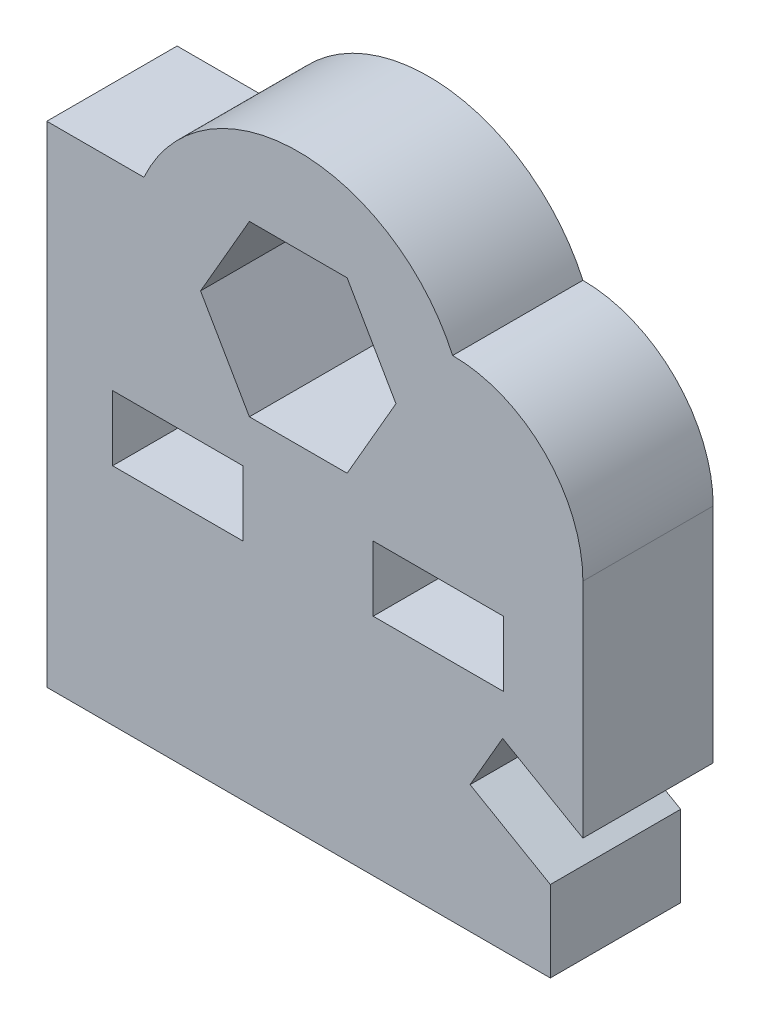
ISO-10303-21;
HEADER;
FILE_DESCRIPTION(('STEP AP214'),'2;1');
FILE_NAME('part.step','',(''),(''),'','','');
FILE_SCHEMA(('AUTOMOTIVE_DESIGN { 1 0 10303 214 1 1 1 1 }'));
ENDSEC;
DATA;
#1=APPLICATION_CONTEXT('core data for automotive mechanical design processes');
#2=APPLICATION_PROTOCOL_DEFINITION('international standard','automotive_design',2000,#1);
#3=PRODUCT_CONTEXT('',#1,'mechanical');
#4=PRODUCT('Part','Part','',(#3));
#5=PRODUCT_RELATED_PRODUCT_CATEGORY('part','',(#4));
#6=PRODUCT_DEFINITION_FORMATION('','',#4);
#7=PRODUCT_DEFINITION_CONTEXT('part definition',#1,'design');
#8=PRODUCT_DEFINITION('design','',#6,#7);
#9=PRODUCT_DEFINITION_SHAPE('','',#8);
#10=(LENGTH_UNIT() NAMED_UNIT(*) SI_UNIT(.MILLI.,.METRE.));
#11=(NAMED_UNIT(*) PLANE_ANGLE_UNIT() SI_UNIT($,.RADIAN.));
#12=(NAMED_UNIT(*) SI_UNIT($,.STERADIAN.) SOLID_ANGLE_UNIT());
#13=UNCERTAINTY_MEASURE_WITH_UNIT(LENGTH_MEASURE(1.E-05),#10,'distance_accuracy_value','');
#14=(GEOMETRIC_REPRESENTATION_CONTEXT(3) GLOBAL_UNCERTAINTY_ASSIGNED_CONTEXT((#13)) GLOBAL_UNIT_ASSIGNED_CONTEXT((#10,
#11,#12)) REPRESENTATION_CONTEXT('',''));
#15=CARTESIAN_POINT('',(0.,0.,0.));
#16=DIRECTION('',(0.,0.,1.));
#17=DIRECTION('',(1.,0.,0.));
#18=AXIS2_PLACEMENT_3D('',#15,#16,#17);
#19=CARTESIAN_POINT('',(13.9396736813884,13.1425512647541,4.));
#20=DIRECTION('',(0.,0.,1.));
#21=DIRECTION('',(1.,0.,0.));
#22=AXIS2_PLACEMENT_3D('',#19,#20,#21);
#23=PLANE('',#22);
#24=DIRECTION('',(0.,-1.,0.));
#25=VECTOR('',#24,1.);
#26=CARTESIAN_POINT('',(11.5,8.99107807997269,4.));
#27=LINE('',#26,#25);
#28=CARTESIAN_POINT('',(11.5,10.9910780799727,4.));
#29=VERTEX_POINT('',#28);
#30=CARTESIAN_POINT('',(11.5,8.99107807997269,4.));
#31=VERTEX_POINT('',#30);
#32=EDGE_CURVE('E247',#29,#31,#27,.T.);
#33=ORIENTED_EDGE('',*,*,#32,.F.);
#34=DIRECTION('',(-1.,0.,0.));
#35=VECTOR('',#34,1.);
#36=CARTESIAN_POINT('',(11.5,10.9910780799727,4.));
#37=LINE('',#36,#35);
#38=CARTESIAN_POINT('',(15.5,10.9910780799727,4.));
#39=VERTEX_POINT('',#38);
#40=EDGE_CURVE('E245',#39,#29,#37,.T.);
#41=ORIENTED_EDGE('',*,*,#40,.F.);
#42=DIRECTION('',(0.,1.,0.));
#43=VECTOR('',#42,1.);
#44=CARTESIAN_POINT('',(15.5,8.99107807997269,4.));
#45=LINE('',#44,#43);
#46=CARTESIAN_POINT('',(15.5,8.99107807997269,4.));
#47=VERTEX_POINT('',#46);
#48=EDGE_CURVE('E253',#47,#39,#45,.T.);
#49=ORIENTED_EDGE('',*,*,#48,.F.);
#50=DIRECTION('',(1.,0.,0.));
#51=VECTOR('',#50,1.);
#52=CARTESIAN_POINT('',(11.5,8.99107807997269,4.));
#53=LINE('',#52,#51);
#54=EDGE_CURVE('E250',#31,#47,#53,.T.);
#55=ORIENTED_EDGE('',*,*,#54,.F.);
#56=EDGE_LOOP('',(#33,#41,#49,#55));
#57=FACE_BOUND('',#56,.T.);
#58=CARTESIAN_POINT('',(13.9396736813884,13.1425512647541,4.));
#59=DIRECTION('',(0.,0.,1.));
#60=DIRECTION('',(1.,0.,0.));
#61=AXIS2_PLACEMENT_3D('',#58,#59,#60);
#62=CIRCLE('',#61,4.);
#63=CARTESIAN_POINT('',(17.9396736813884,13.142551264754,4.));
#64=VERTEX_POINT('',#63);
#65=CARTESIAN_POINT('',(13.9396736813883,17.1425512647541,4.));
#66=VERTEX_POINT('',#65);
#67=EDGE_CURVE('E307',#64,#66,#62,.T.);
#68=ORIENTED_EDGE('',*,*,#67,.T.);
#69=CARTESIAN_POINT('',(9.20000000000002,14.992551264754,4.));
#70=DIRECTION('',(0.,0.,1.));
#71=DIRECTION('',(1.,0.,0.));
#72=AXIS2_PLACEMENT_3D('',#69,#70,#71);
#73=CIRCLE('',#72,5.20451790332642);
#74=CARTESIAN_POINT('',(4.46032631861171,17.1425512647541,4.));
#75=VERTEX_POINT('',#74);
#76=EDGE_CURVE('E310',#66,#75,#73,.T.);
#77=ORIENTED_EDGE('',*,*,#76,.T.);
#78=DIRECTION('',(-1.,0.,0.));
#79=VECTOR('',#78,1.);
#80=CARTESIAN_POINT('',(4.46032631861171,17.1425512647541,4.));
#81=LINE('',#80,#79);
#82=CARTESIAN_POINT('',(1.48,17.1425512647541,4.));
#83=VERTEX_POINT('',#82);
#84=EDGE_CURVE('E313',#75,#83,#81,.T.);
#85=ORIENTED_EDGE('',*,*,#84,.T.);
#86=DIRECTION('',(0.,-1.,0.));
#87=VECTOR('',#86,1.);
#88=CARTESIAN_POINT('',(1.48,17.1425512647541,4.));
#89=LINE('',#88,#87);
#90=CARTESIAN_POINT('',(1.48,2.0910780799727,4.));
#91=VERTEX_POINT('',#90);
#92=EDGE_CURVE('E315',#83,#91,#89,.T.);
#93=ORIENTED_EDGE('',*,*,#92,.T.);
#94=DIRECTION('',(1.,0.,0.));
#95=VECTOR('',#94,1.);
#96=CARTESIAN_POINT('',(16.9396736813884,2.0910780799727,4.));
#97=LINE('',#96,#95);
#98=CARTESIAN_POINT('',(16.9396736813884,2.0910780799727,4.));
#99=VERTEX_POINT('',#98);
#100=EDGE_CURVE('E317',#91,#99,#97,.T.);
#101=ORIENTED_EDGE('',*,*,#100,.T.);
#102=DIRECTION('',(0.,1.,0.));
#103=VECTOR('',#102,1.);
#104=CARTESIAN_POINT('',(16.9396736813884,4.57735026918963,4.));
#105=LINE('',#104,#103);
#106=CARTESIAN_POINT('',(16.9396736813884,4.57735026918963,4.));
#107=VERTEX_POINT('',#106);
#108=EDGE_CURVE('E319',#99,#107,#105,.T.);
#109=ORIENTED_EDGE('',*,*,#108,.T.);
#110=DIRECTION('',(-0.866025403784438,0.5,0.));
#111=VECTOR('',#110,1.);
#112=CARTESIAN_POINT('',(14.4755720662506,6.,4.));
#113=LINE('',#112,#111);
#114=CARTESIAN_POINT('',(14.4755720662506,6.,4.));
#115=VERTEX_POINT('',#114);
#116=EDGE_CURVE('E321',#107,#115,#113,.T.);
#117=ORIENTED_EDGE('',*,*,#116,.T.);
#118=DIRECTION('',(0.500000000000005,0.866025403784436,0.));
#119=VECTOR('',#118,1.);
#120=CARTESIAN_POINT('',(14.4755720662506,6.,4.));
#121=LINE('',#120,#119);
#122=CARTESIAN_POINT('',(15.4755720662506,7.73205080756889,4.));
#123=VERTEX_POINT('',#122);
#124=EDGE_CURVE('E323',#115,#123,#121,.T.);
#125=ORIENTED_EDGE('',*,*,#124,.T.);
#126=DIRECTION('',(0.866025403784436,-0.500000000000005,0.));
#127=VECTOR('',#126,1.);
#128=CARTESIAN_POINT('',(15.4755720662506,7.73205080756889,4.));
#129=LINE('',#128,#127);
#130=CARTESIAN_POINT('',(17.9396736813884,6.30940107675851,4.));
#131=VERTEX_POINT('',#130);
#132=EDGE_CURVE('E325',#123,#131,#129,.T.);
#133=ORIENTED_EDGE('',*,*,#132,.T.);
#134=DIRECTION('',(0.,1.,0.));
#135=VECTOR('',#134,1.);
#136=CARTESIAN_POINT('',(17.9396736813884,13.142551264754,4.));
#137=LINE('',#136,#135);
#138=EDGE_CURVE('E327',#131,#64,#137,.T.);
#139=ORIENTED_EDGE('',*,*,#138,.T.);
#140=EDGE_LOOP('',(#68,#77,#85,#93,#101,#109,#117,#125,#133,#139));
#141=FACE_BOUND('',#140,.T.);
#142=DIRECTION('',(0.,-1.,0.));
#143=VECTOR('',#142,1.);
#144=CARTESIAN_POINT('',(3.5,8.99107807997269,4.));
#145=LINE('',#144,#143);
#146=CARTESIAN_POINT('',(3.5,10.9910780799727,4.));
#147=VERTEX_POINT('',#146);
#148=CARTESIAN_POINT('',(3.5,8.99107807997269,4.));
#149=VERTEX_POINT('',#148);
#150=EDGE_CURVE('E278',#147,#149,#145,.T.);
#151=ORIENTED_EDGE('',*,*,#150,.F.);
#152=DIRECTION('',(-1.,0.,0.));
#153=VECTOR('',#152,1.);
#154=CARTESIAN_POINT('',(3.5,10.9910780799727,4.));
#155=LINE('',#154,#153);
#156=CARTESIAN_POINT('',(7.5,10.9910780799727,4.));
#157=VERTEX_POINT('',#156);
#158=EDGE_CURVE('E276',#157,#147,#155,.T.);
#159=ORIENTED_EDGE('',*,*,#158,.F.);
#160=DIRECTION('',(0.,1.,0.));
#161=VECTOR('',#160,1.);
#162=CARTESIAN_POINT('',(7.5,8.99107807997269,4.));
#163=LINE('',#162,#161);
#164=CARTESIAN_POINT('',(7.5,8.99107807997269,4.));
#165=VERTEX_POINT('',#164);
#166=EDGE_CURVE('E284',#165,#157,#163,.T.);
#167=ORIENTED_EDGE('',*,*,#166,.F.);
#168=DIRECTION('',(1.,0.,0.));
#169=VECTOR('',#168,1.);
#170=CARTESIAN_POINT('',(3.5,8.99107807997269,4.));
#171=LINE('',#170,#169);
#172=EDGE_CURVE('E281',#149,#165,#171,.T.);
#173=ORIENTED_EDGE('',*,*,#172,.F.);
#174=EDGE_LOOP('',(#151,#159,#167,#173));
#175=FACE_BOUND('',#174,.T.);
#176=DIRECTION('',(0.500000000000001,-0.866025403784438,0.));
#177=VECTOR('',#176,1.);
#178=CARTESIAN_POINT('',(6.20000000000001,14.9910780799727,4.));
#179=LINE('',#178,#177);
#180=CARTESIAN_POINT('',(6.20000000000001,14.9910780799727,4.));
#181=VERTEX_POINT('',#180);
#182=CARTESIAN_POINT('',(7.70000000000002,12.3930018686194,4.));
#183=VERTEX_POINT('',#182);
#184=EDGE_CURVE('E202',#181,#183,#179,.T.);
#185=ORIENTED_EDGE('',*,*,#184,.F.);
#186=DIRECTION('',(-0.499999999999995,-0.866025403784442,0.));
#187=VECTOR('',#186,1.);
#188=CARTESIAN_POINT('',(7.69999999999998,17.589154291326,4.));
#189=LINE('',#188,#187);
#190=CARTESIAN_POINT('',(7.69999999999998,17.589154291326,4.));
#191=VERTEX_POINT('',#190);
#192=EDGE_CURVE('E194',#191,#181,#189,.T.);
#193=ORIENTED_EDGE('',*,*,#192,.F.);
#194=DIRECTION('',(-1.,0.,0.));
#195=VECTOR('',#194,1.);
#196=CARTESIAN_POINT('',(10.7,17.589154291326,4.));
#197=LINE('',#196,#195);
#198=CARTESIAN_POINT('',(10.7,17.589154291326,4.));
#199=VERTEX_POINT('',#198);
#200=EDGE_CURVE('E223',#199,#191,#197,.T.);
#201=ORIENTED_EDGE('',*,*,#200,.F.);
#202=DIRECTION('',(-0.500000000000007,0.866025403784435,0.));
#203=VECTOR('',#202,1.);
#204=CARTESIAN_POINT('',(12.2,14.9910780799727,4.));
#205=LINE('',#204,#203);
#206=CARTESIAN_POINT('',(12.2,14.9910780799727,4.));
#207=VERTEX_POINT('',#206);
#208=EDGE_CURVE('E221',#207,#199,#205,.T.);
#209=ORIENTED_EDGE('',*,*,#208,.F.);
#210=DIRECTION('',(0.499999999999995,0.866025403784442,0.));
#211=VECTOR('',#210,1.);
#212=CARTESIAN_POINT('',(10.7,12.3930018686194,4.));
#213=LINE('',#212,#211);
#214=CARTESIAN_POINT('',(10.7,12.3930018686194,4.));
#215=VERTEX_POINT('',#214);
#216=EDGE_CURVE('E217',#215,#207,#213,.T.);
#217=ORIENTED_EDGE('',*,*,#216,.F.);
#218=DIRECTION('',(1.,0.,0.));
#219=VECTOR('',#218,1.);
#220=CARTESIAN_POINT('',(7.70000000000002,12.3930018686194,4.));
#221=LINE('',#220,#219);
#222=EDGE_CURVE('E215',#183,#215,#221,.T.);
#223=ORIENTED_EDGE('',*,*,#222,.F.);
#224=EDGE_LOOP('',(#185,#193,#201,#209,#217,#223));
#225=FACE_BOUND('',#224,.T.);
#226=ADVANCED_FACE('F33',(#57,#141,#175,#225),#23,.T.);
#227=CARTESIAN_POINT('',(13.9396736813884,13.1425512647541,0.));
#228=DIRECTION('',(0.,0.,1.));
#229=DIRECTION('',(1.,0.,0.));
#230=AXIS2_PLACEMENT_3D('',#227,#228,#229);
#231=PLANE('',#230);
#232=DIRECTION('',(-1.,0.,0.));
#233=VECTOR('',#232,1.);
#234=CARTESIAN_POINT('',(11.5,10.9910780799727,0.));
#235=LINE('',#234,#233);
#236=CARTESIAN_POINT('',(15.5,10.9910780799727,0.));
#237=VERTEX_POINT('',#236);
#238=CARTESIAN_POINT('',(11.5,10.9910780799727,0.));
#239=VERTEX_POINT('',#238);
#240=EDGE_CURVE('E210',#237,#239,#235,.T.);
#241=ORIENTED_EDGE('',*,*,#240,.T.);
#242=DIRECTION('',(0.,-1.,0.));
#243=VECTOR('',#242,1.);
#244=CARTESIAN_POINT('',(11.5,8.99107807997269,0.));
#245=LINE('',#244,#243);
#246=CARTESIAN_POINT('',(11.5,8.99107807997269,0.));
#247=VERTEX_POINT('',#246);
#248=EDGE_CURVE('E258',#239,#247,#245,.T.);
#249=ORIENTED_EDGE('',*,*,#248,.T.);
#250=DIRECTION('',(1.,0.,0.));
#251=VECTOR('',#250,1.);
#252=CARTESIAN_POINT('',(11.5,8.99107807997269,0.));
#253=LINE('',#252,#251);
#254=CARTESIAN_POINT('',(15.5,8.99107807997269,0.));
#255=VERTEX_POINT('',#254);
#256=EDGE_CURVE('E261',#247,#255,#253,.T.);
#257=ORIENTED_EDGE('',*,*,#256,.T.);
#258=DIRECTION('',(0.,1.,0.));
#259=VECTOR('',#258,1.);
#260=CARTESIAN_POINT('',(15.5,8.99107807997269,0.));
#261=LINE('',#260,#259);
#262=EDGE_CURVE('E248',#255,#237,#261,.T.);
#263=ORIENTED_EDGE('',*,*,#262,.T.);
#264=EDGE_LOOP('',(#241,#249,#257,#263));
#265=FACE_BOUND('',#264,.T.);
#266=CARTESIAN_POINT('',(13.9396736813884,13.1425512647541,0.));
#267=DIRECTION('',(0.,0.,1.));
#268=DIRECTION('',(1.,0.,0.));
#269=AXIS2_PLACEMENT_3D('',#266,#267,#268);
#270=CIRCLE('',#269,4.);
#271=CARTESIAN_POINT('',(17.9396736813884,13.142551264754,0.));
#272=VERTEX_POINT('',#271);
#273=CARTESIAN_POINT('',(13.9396736813883,17.1425512647541,0.));
#274=VERTEX_POINT('',#273);
#275=EDGE_CURVE('E306',#272,#274,#270,.T.);
#276=ORIENTED_EDGE('',*,*,#275,.F.);
#277=DIRECTION('',(0.,1.,0.));
#278=VECTOR('',#277,1.);
#279=CARTESIAN_POINT('',(17.9396736813884,13.142551264754,0.));
#280=LINE('',#279,#278);
#281=CARTESIAN_POINT('',(17.9396736813884,6.30940107675851,0.));
#282=VERTEX_POINT('',#281);
#283=EDGE_CURVE('E311',#282,#272,#280,.T.);
#284=ORIENTED_EDGE('',*,*,#283,.F.);
#285=DIRECTION('',(0.866025403784436,-0.500000000000005,0.));
#286=VECTOR('',#285,1.);
#287=CARTESIAN_POINT('',(15.4755720662506,7.73205080756889,0.));
#288=LINE('',#287,#286);
#289=CARTESIAN_POINT('',(15.4755720662506,7.73205080756889,0.));
#290=VERTEX_POINT('',#289);
#291=EDGE_CURVE('E346',#290,#282,#288,.T.);
#292=ORIENTED_EDGE('',*,*,#291,.F.);
#293=DIRECTION('',(0.500000000000005,0.866025403784436,0.));
#294=VECTOR('',#293,1.);
#295=CARTESIAN_POINT('',(14.4755720662506,6.,0.));
#296=LINE('',#295,#294);
#297=CARTESIAN_POINT('',(14.4755720662506,6.,0.));
#298=VERTEX_POINT('',#297);
#299=EDGE_CURVE('E344',#298,#290,#296,.T.);
#300=ORIENTED_EDGE('',*,*,#299,.F.);
#301=DIRECTION('',(-0.866025403784438,0.5,0.));
#302=VECTOR('',#301,1.);
#303=CARTESIAN_POINT('',(14.4755720662506,6.,0.));
#304=LINE('',#303,#302);
#305=CARTESIAN_POINT('',(16.9396736813884,4.57735026918963,0.));
#306=VERTEX_POINT('',#305);
#307=EDGE_CURVE('E342',#306,#298,#304,.T.);
#308=ORIENTED_EDGE('',*,*,#307,.F.);
#309=DIRECTION('',(0.,1.,0.));
#310=VECTOR('',#309,1.);
#311=CARTESIAN_POINT('',(16.9396736813884,4.57735026918963,0.));
#312=LINE('',#311,#310);
#313=CARTESIAN_POINT('',(16.9396736813884,2.0910780799727,0.));
#314=VERTEX_POINT('',#313);
#315=EDGE_CURVE('E340',#314,#306,#312,.T.);
#316=ORIENTED_EDGE('',*,*,#315,.F.);
#317=DIRECTION('',(1.,0.,0.));
#318=VECTOR('',#317,1.);
#319=CARTESIAN_POINT('',(16.9396736813884,2.0910780799727,0.));
#320=LINE('',#319,#318);
#321=CARTESIAN_POINT('',(1.48,2.0910780799727,0.));
#322=VERTEX_POINT('',#321);
#323=EDGE_CURVE('E338',#322,#314,#320,.T.);
#324=ORIENTED_EDGE('',*,*,#323,.F.);
#325=DIRECTION('',(0.,-1.,0.));
#326=VECTOR('',#325,1.);
#327=CARTESIAN_POINT('',(1.48,17.1425512647541,0.));
#328=LINE('',#327,#326);
#329=CARTESIAN_POINT('',(1.48,17.1425512647541,0.));
#330=VERTEX_POINT('',#329);
#331=EDGE_CURVE('E336',#330,#322,#328,.T.);
#332=ORIENTED_EDGE('',*,*,#331,.F.);
#333=DIRECTION('',(-1.,0.,0.));
#334=VECTOR('',#333,1.);
#335=CARTESIAN_POINT('',(4.46032631861171,17.1425512647541,0.));
#336=LINE('',#335,#334);
#337=CARTESIAN_POINT('',(4.46032631861171,17.1425512647541,0.));
#338=VERTEX_POINT('',#337);
#339=EDGE_CURVE('E334',#338,#330,#336,.T.);
#340=ORIENTED_EDGE('',*,*,#339,.F.);
#341=CARTESIAN_POINT('',(9.20000000000002,14.992551264754,0.));
#342=DIRECTION('',(0.,0.,1.));
#343=DIRECTION('',(1.,0.,0.));
#344=AXIS2_PLACEMENT_3D('',#341,#342,#343);
#345=CIRCLE('',#344,5.20451790332642);
#346=EDGE_CURVE('E332',#274,#338,#345,.T.);
#347=ORIENTED_EDGE('',*,*,#346,.F.);
#348=EDGE_LOOP('',(#276,#284,#292,#300,#308,#316,#324,#332,#340,#347));
#349=FACE_BOUND('',#348,.T.);
#350=DIRECTION('',(-1.,0.,0.));
#351=VECTOR('',#350,1.);
#352=CARTESIAN_POINT('',(3.5,10.9910780799727,0.));
#353=LINE('',#352,#351);
#354=CARTESIAN_POINT('',(7.5,10.9910780799727,0.));
#355=VERTEX_POINT('',#354);
#356=CARTESIAN_POINT('',(3.5,10.9910780799727,0.));
#357=VERTEX_POINT('',#356);
#358=EDGE_CURVE('E275',#355,#357,#353,.T.);
#359=ORIENTED_EDGE('',*,*,#358,.T.);
#360=DIRECTION('',(0.,-1.,0.));
#361=VECTOR('',#360,1.);
#362=CARTESIAN_POINT('',(3.5,8.99107807997269,0.));
#363=LINE('',#362,#361);
#364=CARTESIAN_POINT('',(3.5,8.99107807997269,0.));
#365=VERTEX_POINT('',#364);
#366=EDGE_CURVE('E289',#357,#365,#363,.T.);
#367=ORIENTED_EDGE('',*,*,#366,.T.);
#368=DIRECTION('',(1.,0.,0.));
#369=VECTOR('',#368,1.);
#370=CARTESIAN_POINT('',(3.5,8.99107807997269,0.));
#371=LINE('',#370,#369);
#372=CARTESIAN_POINT('',(7.5,8.99107807997269,0.));
#373=VERTEX_POINT('',#372);
#374=EDGE_CURVE('E292',#365,#373,#371,.T.);
#375=ORIENTED_EDGE('',*,*,#374,.T.);
#376=DIRECTION('',(0.,1.,0.));
#377=VECTOR('',#376,1.);
#378=CARTESIAN_POINT('',(7.5,8.99107807997269,0.));
#379=LINE('',#378,#377);
#380=EDGE_CURVE('E279',#373,#355,#379,.T.);
#381=ORIENTED_EDGE('',*,*,#380,.T.);
#382=EDGE_LOOP('',(#359,#367,#375,#381));
#383=FACE_BOUND('',#382,.T.);
#384=DIRECTION('',(-0.499999999999995,-0.866025403784442,0.));
#385=VECTOR('',#384,1.);
#386=CARTESIAN_POINT('',(7.69999999999998,17.589154291326,0.));
#387=LINE('',#386,#385);
#388=CARTESIAN_POINT('',(7.69999999999998,17.589154291326,0.));
#389=VERTEX_POINT('',#388);
#390=CARTESIAN_POINT('',(6.20000000000001,14.9910780799727,0.));
#391=VERTEX_POINT('',#390);
#392=EDGE_CURVE('E56',#389,#391,#387,.T.);
#393=ORIENTED_EDGE('',*,*,#392,.T.);
#394=DIRECTION('',(0.500000000000001,-0.866025403784438,0.));
#395=VECTOR('',#394,1.);
#396=CARTESIAN_POINT('',(6.20000000000001,14.9910780799727,0.));
#397=LINE('',#396,#395);
#398=CARTESIAN_POINT('',(7.70000000000002,12.3930018686194,0.));
#399=VERTEX_POINT('',#398);
#400=EDGE_CURVE('E209',#391,#399,#397,.T.);
#401=ORIENTED_EDGE('',*,*,#400,.T.);
#402=DIRECTION('',(1.,0.,0.));
#403=VECTOR('',#402,1.);
#404=CARTESIAN_POINT('',(7.70000000000002,12.3930018686194,0.));
#405=LINE('',#404,#403);
#406=CARTESIAN_POINT('',(10.7,12.3930018686194,0.));
#407=VERTEX_POINT('',#406);
#408=EDGE_CURVE('E227',#399,#407,#405,.T.);
#409=ORIENTED_EDGE('',*,*,#408,.T.);
#410=DIRECTION('',(0.499999999999995,0.866025403784442,0.));
#411=VECTOR('',#410,1.);
#412=CARTESIAN_POINT('',(10.7,12.3930018686194,0.));
#413=LINE('',#412,#411);
#414=CARTESIAN_POINT('',(12.2,14.9910780799727,0.));
#415=VERTEX_POINT('',#414);
#416=EDGE_CURVE('E230',#407,#415,#413,.T.);
#417=ORIENTED_EDGE('',*,*,#416,.T.);
#418=DIRECTION('',(-0.500000000000007,0.866025403784435,0.));
#419=VECTOR('',#418,1.);
#420=CARTESIAN_POINT('',(12.2,14.9910780799727,0.));
#421=LINE('',#420,#419);
#422=CARTESIAN_POINT('',(10.7,17.589154291326,0.));
#423=VERTEX_POINT('',#422);
#424=EDGE_CURVE('E233',#415,#423,#421,.T.);
#425=ORIENTED_EDGE('',*,*,#424,.T.);
#426=DIRECTION('',(-1.,0.,0.));
#427=VECTOR('',#426,1.);
#428=CARTESIAN_POINT('',(10.7,17.589154291326,0.));
#429=LINE('',#428,#427);
#430=EDGE_CURVE('E203',#423,#389,#429,.T.);
#431=ORIENTED_EDGE('',*,*,#430,.T.);
#432=EDGE_LOOP('',(#393,#401,#409,#417,#425,#431));
#433=FACE_BOUND('',#432,.T.);
#434=ADVANCED_FACE('F382',(#265,#349,#383,#433),#231,.F.);
#435=CARTESIAN_POINT('',(13.9396736813884,13.1425512647541,4.));
#436=DIRECTION('',(0.,0.,-1.));
#437=DIRECTION('',(-1.,0.,0.));
#438=AXIS2_PLACEMENT_3D('',#435,#436,#437);
#439=CYLINDRICAL_SURFACE('',#438,4.);
#440=ORIENTED_EDGE('',*,*,#275,.T.);
#441=DIRECTION('',(0.,0.,-1.));
#442=VECTOR('',#441,1.);
#443=CARTESIAN_POINT('',(13.9396736813883,17.1425512647541,4.));
#444=LINE('',#443,#442);
#445=EDGE_CURVE('E11',#66,#274,#444,.T.);
#446=ORIENTED_EDGE('',*,*,#445,.F.);
#447=ORIENTED_EDGE('',*,*,#67,.F.);
#448=DIRECTION('',(0.,0.,-1.));
#449=VECTOR('',#448,1.);
#450=CARTESIAN_POINT('',(17.9396736813884,13.142551264754,4.));
#451=LINE('',#450,#449);
#452=EDGE_CURVE('E329',#64,#272,#451,.T.);
#453=ORIENTED_EDGE('',*,*,#452,.T.);
#454=EDGE_LOOP('',(#440,#446,#447,#453));
#455=FACE_BOUND('',#454,.T.);
#456=ADVANCED_FACE('F35',(#455),#439,.T.);
#457=CARTESIAN_POINT('',(9.20000000000002,14.992551264754,4.));
#458=DIRECTION('',(0.,0.,-1.));
#459=DIRECTION('',(-1.,0.,0.));
#460=AXIS2_PLACEMENT_3D('',#457,#458,#459);
#461=CYLINDRICAL_SURFACE('',#460,5.20451790332642);
#462=ORIENTED_EDGE('',*,*,#346,.T.);
#463=DIRECTION('',(0.,0.,-1.));
#464=VECTOR('',#463,1.);
#465=CARTESIAN_POINT('',(4.46032631861171,17.1425512647541,4.));
#466=LINE('',#465,#464);
#467=EDGE_CURVE('E41',#75,#338,#466,.T.);
#468=ORIENTED_EDGE('',*,*,#467,.F.);
#469=ORIENTED_EDGE('',*,*,#76,.F.);
#470=ORIENTED_EDGE('',*,*,#445,.T.);
#471=EDGE_LOOP('',(#462,#468,#469,#470));
#472=FACE_BOUND('',#471,.T.);
#473=ADVANCED_FACE('F400',(#472),#461,.T.);
#474=CARTESIAN_POINT('',(4.46032631861171,17.1425512647541,4.));
#475=DIRECTION('',(0.,-1.,0.));
#476=DIRECTION('',(0.,0.,-1.));
#477=AXIS2_PLACEMENT_3D('',#474,#475,#476);
#478=PLANE('',#477);
#479=ORIENTED_EDGE('',*,*,#339,.T.);
#480=DIRECTION('',(0.,0.,-1.));
#481=VECTOR('',#480,1.);
#482=CARTESIAN_POINT('',(1.48,17.1425512647541,4.));
#483=LINE('',#482,#481);
#484=EDGE_CURVE('E369',#83,#330,#483,.T.);
#485=ORIENTED_EDGE('',*,*,#484,.F.);
#486=ORIENTED_EDGE('',*,*,#84,.F.);
#487=ORIENTED_EDGE('',*,*,#467,.T.);
#488=EDGE_LOOP('',(#479,#485,#486,#487));
#489=FACE_BOUND('',#488,.T.);
#490=ADVANCED_FACE('F376',(#489),#478,.F.);
#491=CARTESIAN_POINT('',(1.48,17.1425512647541,4.));
#492=DIRECTION('',(1.,0.,0.));
#493=DIRECTION('',(0.,1.,0.));
#494=AXIS2_PLACEMENT_3D('',#491,#492,#493);
#495=PLANE('',#494);
#496=ORIENTED_EDGE('',*,*,#331,.T.);
#497=DIRECTION('',(0.,0.,-1.));
#498=VECTOR('',#497,1.);
#499=CARTESIAN_POINT('',(1.48,2.0910780799727,4.));
#500=LINE('',#499,#498);
#501=EDGE_CURVE('E366',#91,#322,#500,.T.);
#502=ORIENTED_EDGE('',*,*,#501,.F.);
#503=ORIENTED_EDGE('',*,*,#92,.F.);
#504=ORIENTED_EDGE('',*,*,#484,.T.);
#505=EDGE_LOOP('',(#496,#502,#503,#504));
#506=FACE_BOUND('',#505,.T.);
#507=ADVANCED_FACE('F388',(#506),#495,.F.);
#508=CARTESIAN_POINT('',(16.9396736813884,2.0910780799727,4.));
#509=DIRECTION('',(0.,1.,0.));
#510=DIRECTION('',(-1.,0.,0.));
#511=AXIS2_PLACEMENT_3D('',#508,#509,#510);
#512=PLANE('',#511);
#513=ORIENTED_EDGE('',*,*,#323,.T.);
#514=DIRECTION('',(0.,0.,-1.));
#515=VECTOR('',#514,1.);
#516=CARTESIAN_POINT('',(16.9396736813884,2.0910780799727,4.));
#517=LINE('',#516,#515);
#518=EDGE_CURVE('E363',#99,#314,#517,.T.);
#519=ORIENTED_EDGE('',*,*,#518,.F.);
#520=ORIENTED_EDGE('',*,*,#100,.F.);
#521=ORIENTED_EDGE('',*,*,#501,.T.);
#522=EDGE_LOOP('',(#513,#519,#520,#521));
#523=FACE_BOUND('',#522,.T.);
#524=ADVANCED_FACE('F392',(#523),#512,.F.);
#525=CARTESIAN_POINT('',(16.9396736813884,4.57735026918963,4.));
#526=DIRECTION('',(-1.,0.,0.));
#527=DIRECTION('',(0.,0.,1.));
#528=AXIS2_PLACEMENT_3D('',#525,#526,#527);
#529=PLANE('',#528);
#530=ORIENTED_EDGE('',*,*,#315,.T.);
#531=DIRECTION('',(0.,0.,-1.));
#532=VECTOR('',#531,1.);
#533=CARTESIAN_POINT('',(16.9396736813884,4.57735026918963,4.));
#534=LINE('',#533,#532);
#535=EDGE_CURVE('E360',#107,#306,#534,.T.);
#536=ORIENTED_EDGE('',*,*,#535,.F.);
#537=ORIENTED_EDGE('',*,*,#108,.F.);
#538=ORIENTED_EDGE('',*,*,#518,.T.);
#539=EDGE_LOOP('',(#530,#536,#537,#538));
#540=FACE_BOUND('',#539,.T.);
#541=ADVANCED_FACE('F423',(#540),#529,.F.);
#542=CARTESIAN_POINT('',(14.4755720662506,6.,4.));
#543=DIRECTION('',(-0.5,-0.866025403784438,0.));
#544=DIRECTION('',(0.866025403784438,-0.5,0.));
#545=AXIS2_PLACEMENT_3D('',#542,#543,#544);
#546=PLANE('',#545);
#547=ORIENTED_EDGE('',*,*,#307,.T.);
#548=DIRECTION('',(0.,0.,-1.));
#549=VECTOR('',#548,1.);
#550=CARTESIAN_POINT('',(14.4755720662506,6.,4.));
#551=LINE('',#550,#549);
#552=EDGE_CURVE('E357',#115,#298,#551,.T.);
#553=ORIENTED_EDGE('',*,*,#552,.F.);
#554=ORIENTED_EDGE('',*,*,#116,.F.);
#555=ORIENTED_EDGE('',*,*,#535,.T.);
#556=EDGE_LOOP('',(#547,#553,#554,#555));
#557=FACE_BOUND('',#556,.T.);
#558=ADVANCED_FACE('F420',(#557),#546,.F.);
#559=CARTESIAN_POINT('',(14.4755720662506,6.,4.));
#560=DIRECTION('',(-0.866025403784436,0.500000000000005,0.));
#561=DIRECTION('',(-0.500000000000005,-0.866025403784436,0.));
#562=AXIS2_PLACEMENT_3D('',#559,#560,#561);
#563=PLANE('',#562);
#564=ORIENTED_EDGE('',*,*,#299,.T.);
#565=DIRECTION('',(0.,0.,-1.));
#566=VECTOR('',#565,1.);
#567=CARTESIAN_POINT('',(15.4755720662506,7.73205080756889,4.));
#568=LINE('',#567,#566);
#569=EDGE_CURVE('E354',#123,#290,#568,.T.);
#570=ORIENTED_EDGE('',*,*,#569,.F.);
#571=ORIENTED_EDGE('',*,*,#124,.F.);
#572=ORIENTED_EDGE('',*,*,#552,.T.);
#573=EDGE_LOOP('',(#564,#570,#571,#572));
#574=FACE_BOUND('',#573,.T.);
#575=ADVANCED_FACE('F416',(#574),#563,.F.);
#576=CARTESIAN_POINT('',(15.4755720662506,7.73205080756889,4.));
#577=DIRECTION('',(0.500000000000005,0.866025403784436,0.));
#578=DIRECTION('',(-0.866025403784436,0.500000000000005,0.));
#579=AXIS2_PLACEMENT_3D('',#576,#577,#578);
#580=PLANE('',#579);
#581=ORIENTED_EDGE('',*,*,#291,.T.);
#582=DIRECTION('',(0.,0.,-1.));
#583=VECTOR('',#582,1.);
#584=CARTESIAN_POINT('',(17.9396736813884,6.30940107675851,4.));
#585=LINE('',#584,#583);
#586=EDGE_CURVE('E351',#131,#282,#585,.T.);
#587=ORIENTED_EDGE('',*,*,#586,.F.);
#588=ORIENTED_EDGE('',*,*,#132,.F.);
#589=ORIENTED_EDGE('',*,*,#569,.T.);
#590=EDGE_LOOP('',(#581,#587,#588,#589));
#591=FACE_BOUND('',#590,.T.);
#592=ADVANCED_FACE('F412',(#591),#580,.F.);
#593=CARTESIAN_POINT('',(17.9396736813884,13.142551264754,4.));
#594=DIRECTION('',(-1.,0.,0.));
#595=DIRECTION('',(0.,0.,1.));
#596=AXIS2_PLACEMENT_3D('',#593,#594,#595);
#597=PLANE('',#596);
#598=ORIENTED_EDGE('',*,*,#283,.T.);
#599=ORIENTED_EDGE('',*,*,#452,.F.);
#600=ORIENTED_EDGE('',*,*,#138,.F.);
#601=ORIENTED_EDGE('',*,*,#586,.T.);
#602=EDGE_LOOP('',(#598,#599,#600,#601));
#603=FACE_BOUND('',#602,.T.);
#604=ADVANCED_FACE('F407',(#603),#597,.F.);
#605=CARTESIAN_POINT('',(3.5,10.9910780799727,4.));
#606=DIRECTION('',(0.,-1.,0.));
#607=DIRECTION('',(0.,0.,-1.));
#608=AXIS2_PLACEMENT_3D('',#605,#606,#607);
#609=PLANE('',#608);
#610=ORIENTED_EDGE('',*,*,#358,.F.);
#611=DIRECTION('',(0.,0.,-1.));
#612=VECTOR('',#611,1.);
#613=CARTESIAN_POINT('',(7.5,10.9910780799727,4.));
#614=LINE('',#613,#612);
#615=EDGE_CURVE('E286',#157,#355,#614,.T.);
#616=ORIENTED_EDGE('',*,*,#615,.F.);
#617=ORIENTED_EDGE('',*,*,#158,.T.);
#618=DIRECTION('',(0.,0.,-1.));
#619=VECTOR('',#618,1.);
#620=CARTESIAN_POINT('',(3.5,10.9910780799727,4.));
#621=LINE('',#620,#619);
#622=EDGE_CURVE('E303',#147,#357,#621,.T.);
#623=ORIENTED_EDGE('',*,*,#622,.T.);
#624=EDGE_LOOP('',(#610,#616,#617,#623));
#625=FACE_BOUND('',#624,.T.);
#626=ADVANCED_FACE('F442',(#625),#609,.T.);
#627=CARTESIAN_POINT('',(3.5,8.99107807997269,4.));
#628=DIRECTION('',(1.,0.,0.));
#629=DIRECTION('',(0.,0.,-1.));
#630=AXIS2_PLACEMENT_3D('',#627,#628,#629);
#631=PLANE('',#630);
#632=ORIENTED_EDGE('',*,*,#366,.F.);
#633=ORIENTED_EDGE('',*,*,#622,.F.);
#634=ORIENTED_EDGE('',*,*,#150,.T.);
#635=DIRECTION('',(0.,0.,-1.));
#636=VECTOR('',#635,1.);
#637=CARTESIAN_POINT('',(3.5,8.99107807997269,4.));
#638=LINE('',#637,#636);
#639=EDGE_CURVE('E301',#149,#365,#638,.T.);
#640=ORIENTED_EDGE('',*,*,#639,.T.);
#641=EDGE_LOOP('',(#632,#633,#634,#640));
#642=FACE_BOUND('',#641,.T.);
#643=ADVANCED_FACE('F468',(#642),#631,.T.);
#644=CARTESIAN_POINT('',(3.5,8.99107807997269,4.));
#645=DIRECTION('',(0.,1.,0.));
#646=DIRECTION('',(0.,0.,1.));
#647=AXIS2_PLACEMENT_3D('',#644,#645,#646);
#648=PLANE('',#647);
#649=ORIENTED_EDGE('',*,*,#374,.F.);
#650=ORIENTED_EDGE('',*,*,#639,.F.);
#651=ORIENTED_EDGE('',*,*,#172,.T.);
#652=DIRECTION('',(0.,0.,-1.));
#653=VECTOR('',#652,1.);
#654=CARTESIAN_POINT('',(7.5,8.99107807997269,4.));
#655=LINE('',#654,#653);
#656=EDGE_CURVE('E299',#165,#373,#655,.T.);
#657=ORIENTED_EDGE('',*,*,#656,.T.);
#658=EDGE_LOOP('',(#649,#650,#651,#657));
#659=FACE_BOUND('',#658,.T.);
#660=ADVANCED_FACE('F475',(#659),#648,.T.);
#661=CARTESIAN_POINT('',(7.5,8.99107807997269,4.));
#662=DIRECTION('',(-1.,0.,0.));
#663=DIRECTION('',(0.,0.,1.));
#664=AXIS2_PLACEMENT_3D('',#661,#662,#663);
#665=PLANE('',#664);
#666=ORIENTED_EDGE('',*,*,#380,.F.);
#667=ORIENTED_EDGE('',*,*,#656,.F.);
#668=ORIENTED_EDGE('',*,*,#166,.T.);
#669=ORIENTED_EDGE('',*,*,#615,.T.);
#670=EDGE_LOOP('',(#666,#667,#668,#669));
#671=FACE_BOUND('',#670,.T.);
#672=ADVANCED_FACE('F482',(#671),#665,.T.);
#673=CARTESIAN_POINT('',(11.5,10.9910780799727,4.));
#674=DIRECTION('',(0.,-1.,0.));
#675=DIRECTION('',(0.,0.,-1.));
#676=AXIS2_PLACEMENT_3D('',#673,#674,#675);
#677=PLANE('',#676);
#678=ORIENTED_EDGE('',*,*,#240,.F.);
#679=DIRECTION('',(0.,0.,-1.));
#680=VECTOR('',#679,1.);
#681=CARTESIAN_POINT('',(15.5,10.9910780799727,4.));
#682=LINE('',#681,#680);
#683=EDGE_CURVE('E255',#39,#237,#682,.T.);
#684=ORIENTED_EDGE('',*,*,#683,.F.);
#685=ORIENTED_EDGE('',*,*,#40,.T.);
#686=DIRECTION('',(0.,0.,-1.));
#687=VECTOR('',#686,1.);
#688=CARTESIAN_POINT('',(11.5,10.9910780799727,4.));
#689=LINE('',#688,#687);
#690=EDGE_CURVE('E272',#29,#239,#689,.T.);
#691=ORIENTED_EDGE('',*,*,#690,.T.);
#692=EDGE_LOOP('',(#678,#684,#685,#691));
#693=FACE_BOUND('',#692,.T.);
#694=ADVANCED_FACE('F490',(#693),#677,.T.);
#695=CARTESIAN_POINT('',(11.5,8.99107807997269,4.));
#696=DIRECTION('',(1.,0.,0.));
#697=DIRECTION('',(0.,0.,-1.));
#698=AXIS2_PLACEMENT_3D('',#695,#696,#697);
#699=PLANE('',#698);
#700=ORIENTED_EDGE('',*,*,#248,.F.);
#701=ORIENTED_EDGE('',*,*,#690,.F.);
#702=ORIENTED_EDGE('',*,*,#32,.T.);
#703=DIRECTION('',(0.,0.,-1.));
#704=VECTOR('',#703,1.);
#705=CARTESIAN_POINT('',(11.5,8.99107807997269,4.));
#706=LINE('',#705,#704);
#707=EDGE_CURVE('E270',#31,#247,#706,.T.);
#708=ORIENTED_EDGE('',*,*,#707,.T.);
#709=EDGE_LOOP('',(#700,#701,#702,#708));
#710=FACE_BOUND('',#709,.T.);
#711=ADVANCED_FACE('F498',(#710),#699,.T.);
#712=CARTESIAN_POINT('',(11.5,8.99107807997269,4.));
#713=DIRECTION('',(0.,1.,0.));
#714=DIRECTION('',(0.,0.,1.));
#715=AXIS2_PLACEMENT_3D('',#712,#713,#714);
#716=PLANE('',#715);
#717=ORIENTED_EDGE('',*,*,#256,.F.);
#718=ORIENTED_EDGE('',*,*,#707,.F.);
#719=ORIENTED_EDGE('',*,*,#54,.T.);
#720=DIRECTION('',(0.,0.,-1.));
#721=VECTOR('',#720,1.);
#722=CARTESIAN_POINT('',(15.5,8.99107807997269,4.));
#723=LINE('',#722,#721);
#724=EDGE_CURVE('E268',#47,#255,#723,.T.);
#725=ORIENTED_EDGE('',*,*,#724,.T.);
#726=EDGE_LOOP('',(#717,#718,#719,#725));
#727=FACE_BOUND('',#726,.T.);
#728=ADVANCED_FACE('F506',(#727),#716,.T.);
#729=CARTESIAN_POINT('',(15.5,8.99107807997269,4.));
#730=DIRECTION('',(-1.,0.,0.));
#731=DIRECTION('',(0.,0.,1.));
#732=AXIS2_PLACEMENT_3D('',#729,#730,#731);
#733=PLANE('',#732);
#734=ORIENTED_EDGE('',*,*,#262,.F.);
#735=ORIENTED_EDGE('',*,*,#724,.F.);
#736=ORIENTED_EDGE('',*,*,#48,.T.);
#737=ORIENTED_EDGE('',*,*,#683,.T.);
#738=EDGE_LOOP('',(#734,#735,#736,#737));
#739=FACE_BOUND('',#738,.T.);
#740=ADVANCED_FACE('F514',(#739),#733,.T.);
#741=CARTESIAN_POINT('',(7.69999999999998,17.589154291326,4.));
#742=DIRECTION('',(0.866025403784442,-0.499999999999995,0.));
#743=DIRECTION('',(0.499999999999995,0.866025403784442,0.));
#744=AXIS2_PLACEMENT_3D('',#741,#742,#743);
#745=PLANE('',#744);
#746=ORIENTED_EDGE('',*,*,#392,.F.);
#747=DIRECTION('',(0.,0.,-1.));
#748=VECTOR('',#747,1.);
#749=CARTESIAN_POINT('',(7.69999999999998,17.589154291326,4.));
#750=LINE('',#749,#748);
#751=EDGE_CURVE('E198',#191,#389,#750,.T.);
#752=ORIENTED_EDGE('',*,*,#751,.F.);
#753=ORIENTED_EDGE('',*,*,#192,.T.);
#754=DIRECTION('',(0.,0.,-1.));
#755=VECTOR('',#754,1.);
#756=CARTESIAN_POINT('',(6.20000000000001,14.9910780799727,4.));
#757=LINE('',#756,#755);
#758=EDGE_CURVE('E197',#181,#391,#757,.T.);
#759=ORIENTED_EDGE('',*,*,#758,.T.);
#760=EDGE_LOOP('',(#746,#752,#753,#759));
#761=FACE_BOUND('',#760,.T.);
#762=ADVANCED_FACE('F196',(#761),#745,.T.);
#763=CARTESIAN_POINT('',(6.20000000000001,14.9910780799727,4.));
#764=DIRECTION('',(0.866025403784438,0.500000000000001,0.));
#765=DIRECTION('',(-0.500000000000001,0.866025403784438,0.));
#766=AXIS2_PLACEMENT_3D('',#763,#764,#765);
#767=PLANE('',#766);
#768=ORIENTED_EDGE('',*,*,#400,.F.);
#769=ORIENTED_EDGE('',*,*,#758,.F.);
#770=ORIENTED_EDGE('',*,*,#184,.T.);
#771=DIRECTION('',(0.,0.,-1.));
#772=VECTOR('',#771,1.);
#773=CARTESIAN_POINT('',(7.70000000000002,12.3930018686194,4.));
#774=LINE('',#773,#772);
#775=EDGE_CURVE('E211',#183,#399,#774,.T.);
#776=ORIENTED_EDGE('',*,*,#775,.T.);
#777=EDGE_LOOP('',(#768,#769,#770,#776));
#778=FACE_BOUND('',#777,.T.);
#779=ADVANCED_FACE('F206',(#778),#767,.T.);
#780=CARTESIAN_POINT('',(7.70000000000002,12.3930018686194,4.));
#781=DIRECTION('',(0.,1.,0.));
#782=DIRECTION('',(-1.,0.,0.));
#783=AXIS2_PLACEMENT_3D('',#780,#781,#782);
#784=PLANE('',#783);
#785=ORIENTED_EDGE('',*,*,#408,.F.);
#786=ORIENTED_EDGE('',*,*,#775,.F.);
#787=ORIENTED_EDGE('',*,*,#222,.T.);
#788=DIRECTION('',(0.,0.,-1.));
#789=VECTOR('',#788,1.);
#790=CARTESIAN_POINT('',(10.7,12.3930018686194,4.));
#791=LINE('',#790,#789);
#792=EDGE_CURVE('E242',#215,#407,#791,.T.);
#793=ORIENTED_EDGE('',*,*,#792,.T.);
#794=EDGE_LOOP('',(#785,#786,#787,#793));
#795=FACE_BOUND('',#794,.T.);
#796=ADVANCED_FACE('F535',(#795),#784,.T.);
#797=CARTESIAN_POINT('',(10.7,12.3930018686194,4.));
#798=DIRECTION('',(-0.866025403784442,0.499999999999995,0.));
#799=DIRECTION('',(-0.499999999999995,-0.866025403784442,0.));
#800=AXIS2_PLACEMENT_3D('',#797,#798,#799);
#801=PLANE('',#800);
#802=ORIENTED_EDGE('',*,*,#416,.F.);
#803=ORIENTED_EDGE('',*,*,#792,.F.);
#804=ORIENTED_EDGE('',*,*,#216,.T.);
#805=DIRECTION('',(0.,0.,-1.));
#806=VECTOR('',#805,1.);
#807=CARTESIAN_POINT('',(12.2,14.9910780799727,4.));
#808=LINE('',#807,#806);
#809=EDGE_CURVE('E240',#207,#415,#808,.T.);
#810=ORIENTED_EDGE('',*,*,#809,.T.);
#811=EDGE_LOOP('',(#802,#803,#804,#810));
#812=FACE_BOUND('',#811,.T.);
#813=ADVANCED_FACE('F542',(#812),#801,.T.);
#814=CARTESIAN_POINT('',(12.2,14.9910780799727,4.));
#815=DIRECTION('',(-0.866025403784435,-0.500000000000007,0.));
#816=DIRECTION('',(0.500000000000007,-0.866025403784435,0.));
#817=AXIS2_PLACEMENT_3D('',#814,#815,#816);
#818=PLANE('',#817);
#819=ORIENTED_EDGE('',*,*,#424,.F.);
#820=ORIENTED_EDGE('',*,*,#809,.F.);
#821=ORIENTED_EDGE('',*,*,#208,.T.);
#822=DIRECTION('',(0.,0.,-1.));
#823=VECTOR('',#822,1.);
#824=CARTESIAN_POINT('',(10.7,17.589154291326,4.));
#825=LINE('',#824,#823);
#826=EDGE_CURVE('E48',#199,#423,#825,.T.);
#827=ORIENTED_EDGE('',*,*,#826,.T.);
#828=EDGE_LOOP('',(#819,#820,#821,#827));
#829=FACE_BOUND('',#828,.T.);
#830=ADVANCED_FACE('F550',(#829),#818,.T.);
#831=CARTESIAN_POINT('',(10.7,17.589154291326,4.));
#832=DIRECTION('',(0.,-1.,0.));
#833=DIRECTION('',(1.,0.,0.));
#834=AXIS2_PLACEMENT_3D('',#831,#832,#833);
#835=PLANE('',#834);
#836=ORIENTED_EDGE('',*,*,#430,.F.);
#837=ORIENTED_EDGE('',*,*,#826,.F.);
#838=ORIENTED_EDGE('',*,*,#200,.T.);
#839=ORIENTED_EDGE('',*,*,#751,.T.);
#840=EDGE_LOOP('',(#836,#837,#838,#839));
#841=FACE_BOUND('',#840,.T.);
#842=ADVANCED_FACE('F558',(#841),#835,.T.);
#843=CLOSED_SHELL('',(#226,#434,#456,#473,#490,#507,#524,#541,#558,#575,#592,#604,#626,#643,
#660,#672,#694,#711,#728,#740,#762,#779,#796,#813,#830,#842));
#844=MANIFOLD_SOLID_BREP('B2',#843);
#845=ADVANCED_BREP_SHAPE_REPRESENTATION('',(#18,#844),#14);
#846=SHAPE_DEFINITION_REPRESENTATION(#9,#845);
ENDSEC;
END-ISO-10303-21;
